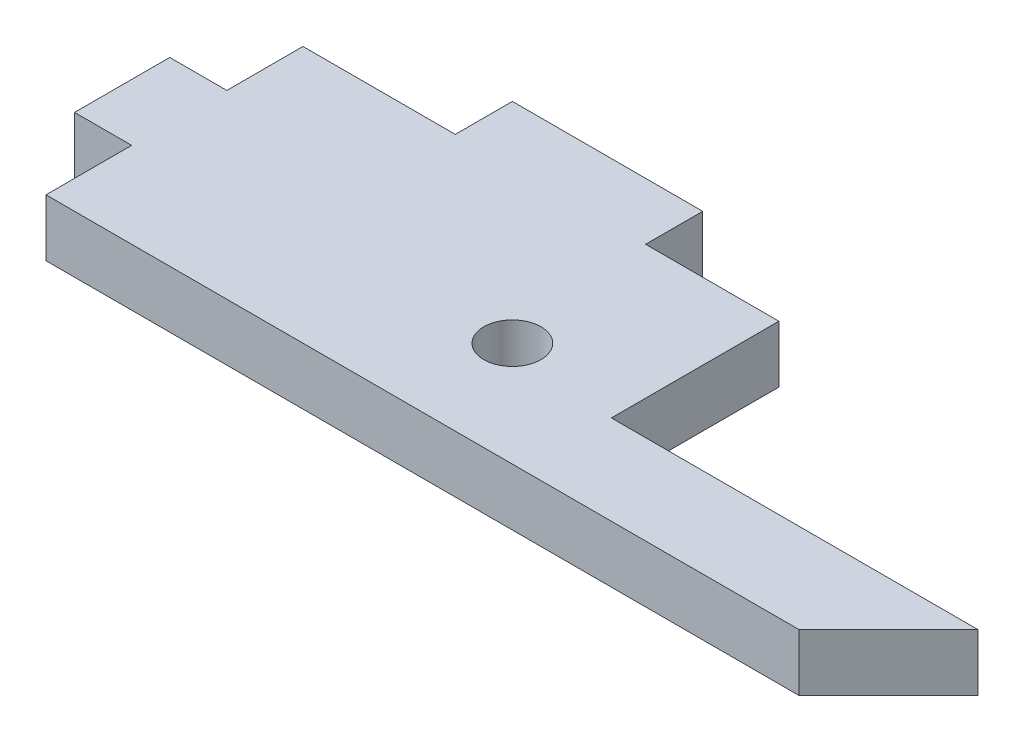
ISO-10303-21;
HEADER;
FILE_DESCRIPTION(('STEP AP214'),'2;1');
FILE_NAME('part.step','',(''),(''),'','','');
FILE_SCHEMA(('AUTOMOTIVE_DESIGN { 1 0 10303 214 1 1 1 1 }'));
ENDSEC;
DATA;
#1=APPLICATION_CONTEXT('core data for automotive mechanical design processes');
#2=APPLICATION_PROTOCOL_DEFINITION('international standard','automotive_design',2000,#1);
#3=PRODUCT_CONTEXT('',#1,'mechanical');
#4=PRODUCT('Part','Part','',(#3));
#5=PRODUCT_RELATED_PRODUCT_CATEGORY('part','',(#4));
#6=PRODUCT_DEFINITION_FORMATION('','',#4);
#7=PRODUCT_DEFINITION_CONTEXT('part definition',#1,'design');
#8=PRODUCT_DEFINITION('design','',#6,#7);
#9=PRODUCT_DEFINITION_SHAPE('','',#8);
#10=(LENGTH_UNIT() NAMED_UNIT(*) SI_UNIT(.MILLI.,.METRE.));
#11=(NAMED_UNIT(*) PLANE_ANGLE_UNIT() SI_UNIT($,.RADIAN.));
#12=(NAMED_UNIT(*) SI_UNIT($,.STERADIAN.) SOLID_ANGLE_UNIT());
#13=UNCERTAINTY_MEASURE_WITH_UNIT(LENGTH_MEASURE(1.E-05),#10,'distance_accuracy_value','');
#14=(GEOMETRIC_REPRESENTATION_CONTEXT(3) GLOBAL_UNCERTAINTY_ASSIGNED_CONTEXT((#13)) GLOBAL_UNIT_ASSIGNED_CONTEXT((#10,
#11,#12)) REPRESENTATION_CONTEXT('',''));
#15=CARTESIAN_POINT('',(0.,0.,0.));
#16=DIRECTION('',(0.,0.,1.));
#17=DIRECTION('',(1.,0.,0.));
#18=AXIS2_PLACEMENT_3D('',#15,#16,#17);
#19=CARTESIAN_POINT('',(0.,3.,0.));
#20=DIRECTION('',(0.,-1.,0.));
#21=DIRECTION('',(0.,0.,-1.));
#22=AXIS2_PLACEMENT_3D('',#19,#20,#21);
#23=PLANE('',#22);
#24=DIRECTION('',(0.,0.,1.));
#25=VECTOR('',#24,1.);
#26=CARTESIAN_POINT('',(-45.8890246544318,3.,12.6810465595323));
#27=LINE('',#26,#25);
#28=CARTESIAN_POINT('',(-45.8890246544318,3.,8.18104655953229));
#29=VERTEX_POINT('',#28);
#30=CARTESIAN_POINT('',(-45.8890246544318,3.,12.6810465595323));
#31=VERTEX_POINT('',#30);
#32=EDGE_CURVE('E192',#29,#31,#27,.T.);
#33=ORIENTED_EDGE('',*,*,#32,.T.);
#34=DIRECTION('',(1.,0.,0.));
#35=VECTOR('',#34,1.);
#36=CARTESIAN_POINT('',(-6.32902465443183,3.,12.6810465595323));
#37=LINE('',#36,#35);
#38=CARTESIAN_POINT('',(-6.32902465443183,3.,12.6810465595323));
#39=VERTEX_POINT('',#38);
#40=EDGE_CURVE('E110',#31,#39,#37,.T.);
#41=ORIENTED_EDGE('',*,*,#40,.T.);
#42=DIRECTION('',(0.707106781186546,0.,-0.707106781186549));
#43=VECTOR('',#42,1.);
#44=CARTESIAN_POINT('',(-1.62902465443185,3.,7.98104655953229));
#45=LINE('',#44,#43);
#46=CARTESIAN_POINT('',(-1.62902465443185,3.,7.98104655953229));
#47=VERTEX_POINT('',#46);
#48=EDGE_CURVE('E225',#39,#47,#45,.T.);
#49=ORIENTED_EDGE('',*,*,#48,.T.);
#50=DIRECTION('',(-1.,0.,0.));
#51=VECTOR('',#50,1.);
#52=CARTESIAN_POINT('',(-20.8890246544319,3.,7.98104655953229));
#53=LINE('',#52,#51);
#54=CARTESIAN_POINT('',(-20.8890246544319,3.,7.98104655953229));
#55=VERTEX_POINT('',#54);
#56=EDGE_CURVE('E244',#47,#55,#53,.T.);
#57=ORIENTED_EDGE('',*,*,#56,.T.);
#58=DIRECTION('',(0.,0.,-1.));
#59=VECTOR('',#58,1.);
#60=CARTESIAN_POINT('',(-20.8890246544319,3.,-0.818953440467708));
#61=LINE('',#60,#59);
#62=CARTESIAN_POINT('',(-20.8890246544319,3.,-0.818953440467708));
#63=VERTEX_POINT('',#62);
#64=EDGE_CURVE('E241',#55,#63,#61,.T.);
#65=ORIENTED_EDGE('',*,*,#64,.T.);
#66=DIRECTION('',(-1.,0.,0.));
#67=VECTOR('',#66,1.);
#68=CARTESIAN_POINT('',(-27.8890246544319,3.,-0.818953440467708));
#69=LINE('',#68,#67);
#70=CARTESIAN_POINT('',(-27.8890246544319,3.,-0.818953440467708));
#71=VERTEX_POINT('',#70);
#72=EDGE_CURVE('E243',#63,#71,#69,.T.);
#73=ORIENTED_EDGE('',*,*,#72,.T.);
#74=DIRECTION('',(0.,0.,-1.));
#75=VECTOR('',#74,1.);
#76=CARTESIAN_POINT('',(-27.8890246544318,3.,-3.81895344046771));
#77=LINE('',#76,#75);
#78=CARTESIAN_POINT('',(-27.8890246544318,3.,-3.81895344046771));
#79=VERTEX_POINT('',#78);
#80=EDGE_CURVE('E246',#71,#79,#77,.T.);
#81=ORIENTED_EDGE('',*,*,#80,.T.);
#82=DIRECTION('',(-1.,0.,0.));
#83=VECTOR('',#82,1.);
#84=CARTESIAN_POINT('',(-37.8890246544319,3.,-3.81895344046771));
#85=LINE('',#84,#83);
#86=CARTESIAN_POINT('',(-37.8890246544319,3.,-3.81895344046771));
#87=VERTEX_POINT('',#86);
#88=EDGE_CURVE('E252',#79,#87,#85,.T.);
#89=ORIENTED_EDGE('',*,*,#88,.T.);
#90=DIRECTION('',(0.,0.,1.));
#91=VECTOR('',#90,1.);
#92=CARTESIAN_POINT('',(-37.8890246544319,3.,-0.818953440467708));
#93=LINE('',#92,#91);
#94=CARTESIAN_POINT('',(-37.8890246544319,3.,-0.818953440467708));
#95=VERTEX_POINT('',#94);
#96=EDGE_CURVE('E254',#87,#95,#93,.T.);
#97=ORIENTED_EDGE('',*,*,#96,.T.);
#98=DIRECTION('',(-1.,0.,0.));
#99=VECTOR('',#98,1.);
#100=CARTESIAN_POINT('',(-45.8890246544319,3.,-0.818953440467708));
#101=LINE('',#100,#99);
#102=CARTESIAN_POINT('',(-45.8890246544319,3.,-0.818953440467708));
#103=VERTEX_POINT('',#102);
#104=EDGE_CURVE('E256',#95,#103,#101,.T.);
#105=ORIENTED_EDGE('',*,*,#104,.T.);
#106=DIRECTION('',(0.,0.,1.));
#107=VECTOR('',#106,1.);
#108=CARTESIAN_POINT('',(-45.8890246544319,3.,3.18104655953229));
#109=LINE('',#108,#107);
#110=CARTESIAN_POINT('',(-45.8890246544319,3.,3.18104655953229));
#111=VERTEX_POINT('',#110);
#112=EDGE_CURVE('E147',#103,#111,#109,.T.);
#113=ORIENTED_EDGE('',*,*,#112,.T.);
#114=DIRECTION('',(-1.,0.,0.));
#115=VECTOR('',#114,1.);
#116=CARTESIAN_POINT('',(-45.8890246544319,3.,3.18104655953229));
#117=LINE('',#116,#115);
#118=CARTESIAN_POINT('',(-48.8890246544318,3.,3.18104655953229));
#119=VERTEX_POINT('',#118);
#120=EDGE_CURVE('E141',#111,#119,#117,.T.);
#121=ORIENTED_EDGE('',*,*,#120,.T.);
#122=DIRECTION('',(0.,0.,1.));
#123=VECTOR('',#122,1.);
#124=CARTESIAN_POINT('',(-48.8890246544318,3.,3.18104655953229));
#125=LINE('',#124,#123);
#126=CARTESIAN_POINT('',(-48.8890246544318,3.,8.18104655953229));
#127=VERTEX_POINT('',#126);
#128=EDGE_CURVE('E145',#119,#127,#125,.T.);
#129=ORIENTED_EDGE('',*,*,#128,.T.);
#130=DIRECTION('',(1.,0.,0.));
#131=VECTOR('',#130,1.);
#132=CARTESIAN_POINT('',(-48.8890246544318,3.,8.18104655953229));
#133=LINE('',#132,#131);
#134=EDGE_CURVE('E49',#127,#29,#133,.T.);
#135=ORIENTED_EDGE('',*,*,#134,.T.);
#136=EDGE_LOOP('',(#33,#41,#49,#57,#65,#73,#81,#89,#97,#105,#113,#121,#129,#135));
#137=FACE_BOUND('',#136,.T.);
#138=CARTESIAN_POINT('',(-26.8890246544318,3.,7.18104655953229));
#139=DIRECTION('',(0.,1.,0.));
#140=DIRECTION('',(0.,0.,1.));
#141=AXIS2_PLACEMENT_3D('',#138,#139,#140);
#142=CIRCLE('',#141,1.5);
#143=CARTESIAN_POINT('',(-26.8890246544318,3.,8.68104655953229));
#144=VERTEX_POINT('',#143);
#145=EDGE_CURVE('E169',#144,#144,#142,.T.);
#146=ORIENTED_EDGE('',*,*,#145,.F.);
#147=EDGE_LOOP('',(#146));
#148=FACE_BOUND('',#147,.T.);
#149=ADVANCED_FACE('F32',(#137,#148),#23,.F.);
#150=CARTESIAN_POINT('',(0.,0.,0.));
#151=DIRECTION('',(0.,-1.,0.));
#152=DIRECTION('',(0.,0.,-1.));
#153=AXIS2_PLACEMENT_3D('',#150,#151,#152);
#154=PLANE('',#153);
#155=DIRECTION('',(0.,0.,1.));
#156=VECTOR('',#155,1.);
#157=CARTESIAN_POINT('',(-45.8890246544318,0.,12.6810465595323));
#158=LINE('',#157,#156);
#159=CARTESIAN_POINT('',(-45.8890246544318,0.,8.18104655953229));
#160=VERTEX_POINT('',#159);
#161=CARTESIAN_POINT('',(-45.8890246544318,0.,12.6810465595323));
#162=VERTEX_POINT('',#161);
#163=EDGE_CURVE('E165',#160,#162,#158,.T.);
#164=ORIENTED_EDGE('',*,*,#163,.F.);
#165=DIRECTION('',(1.,0.,0.));
#166=VECTOR('',#165,1.);
#167=CARTESIAN_POINT('',(-48.8890246544318,0.,8.18104655953229));
#168=LINE('',#167,#166);
#169=CARTESIAN_POINT('',(-48.8890246544318,0.,8.18104655953229));
#170=VERTEX_POINT('',#169);
#171=EDGE_CURVE('E102',#170,#160,#168,.T.);
#172=ORIENTED_EDGE('',*,*,#171,.F.);
#173=DIRECTION('',(0.,0.,1.));
#174=VECTOR('',#173,1.);
#175=CARTESIAN_POINT('',(-48.8890246544318,0.,3.18104655953229));
#176=LINE('',#175,#174);
#177=CARTESIAN_POINT('',(-48.8890246544318,0.,3.18104655953229));
#178=VERTEX_POINT('',#177);
#179=EDGE_CURVE('E96',#178,#170,#176,.T.);
#180=ORIENTED_EDGE('',*,*,#179,.F.);
#181=DIRECTION('',(-1.,0.,0.));
#182=VECTOR('',#181,1.);
#183=CARTESIAN_POINT('',(-45.8890246544319,0.,3.18104655953229));
#184=LINE('',#183,#182);
#185=CARTESIAN_POINT('',(-45.8890246544319,0.,3.18104655953229));
#186=VERTEX_POINT('',#185);
#187=EDGE_CURVE('E155',#186,#178,#184,.T.);
#188=ORIENTED_EDGE('',*,*,#187,.F.);
#189=DIRECTION('',(0.,0.,1.));
#190=VECTOR('',#189,1.);
#191=CARTESIAN_POINT('',(-45.8890246544319,0.,3.18104655953229));
#192=LINE('',#191,#190);
#193=CARTESIAN_POINT('',(-45.8890246544319,0.,-0.818953440467708));
#194=VERTEX_POINT('',#193);
#195=EDGE_CURVE('E187',#194,#186,#192,.T.);
#196=ORIENTED_EDGE('',*,*,#195,.F.);
#197=DIRECTION('',(-1.,0.,0.));
#198=VECTOR('',#197,1.);
#199=CARTESIAN_POINT('',(-45.8890246544319,0.,-0.818953440467708));
#200=LINE('',#199,#198);
#201=CARTESIAN_POINT('',(-37.8890246544319,0.,-0.818953440467708));
#202=VERTEX_POINT('',#201);
#203=EDGE_CURVE('E185',#202,#194,#200,.T.);
#204=ORIENTED_EDGE('',*,*,#203,.F.);
#205=DIRECTION('',(0.,0.,1.));
#206=VECTOR('',#205,1.);
#207=CARTESIAN_POINT('',(-37.8890246544319,0.,-0.818953440467708));
#208=LINE('',#207,#206);
#209=CARTESIAN_POINT('',(-37.8890246544319,0.,-3.81895344046771));
#210=VERTEX_POINT('',#209);
#211=EDGE_CURVE('E183',#210,#202,#208,.T.);
#212=ORIENTED_EDGE('',*,*,#211,.F.);
#213=DIRECTION('',(-1.,0.,0.));
#214=VECTOR('',#213,1.);
#215=CARTESIAN_POINT('',(-37.8890246544319,0.,-3.81895344046771));
#216=LINE('',#215,#214);
#217=CARTESIAN_POINT('',(-27.8890246544318,0.,-3.81895344046771));
#218=VERTEX_POINT('',#217);
#219=EDGE_CURVE('E181',#218,#210,#216,.T.);
#220=ORIENTED_EDGE('',*,*,#219,.F.);
#221=DIRECTION('',(0.,0.,-1.));
#222=VECTOR('',#221,1.);
#223=CARTESIAN_POINT('',(-27.8890246544318,0.,-3.81895344046771));
#224=LINE('',#223,#222);
#225=CARTESIAN_POINT('',(-27.8890246544319,0.,-0.818953440467708));
#226=VERTEX_POINT('',#225);
#227=EDGE_CURVE('E179',#226,#218,#224,.T.);
#228=ORIENTED_EDGE('',*,*,#227,.F.);
#229=DIRECTION('',(-1.,0.,0.));
#230=VECTOR('',#229,1.);
#231=CARTESIAN_POINT('',(-27.8890246544319,0.,-0.818953440467708));
#232=LINE('',#231,#230);
#233=CARTESIAN_POINT('',(-20.8890246544319,0.,-0.818953440467708));
#234=VERTEX_POINT('',#233);
#235=EDGE_CURVE('E177',#234,#226,#232,.T.);
#236=ORIENTED_EDGE('',*,*,#235,.F.);
#237=DIRECTION('',(0.,0.,-1.));
#238=VECTOR('',#237,1.);
#239=CARTESIAN_POINT('',(-20.8890246544319,0.,-0.818953440467708));
#240=LINE('',#239,#238);
#241=CARTESIAN_POINT('',(-20.8890246544319,0.,7.98104655953229));
#242=VERTEX_POINT('',#241);
#243=EDGE_CURVE('E175',#242,#234,#240,.T.);
#244=ORIENTED_EDGE('',*,*,#243,.F.);
#245=DIRECTION('',(-1.,0.,0.));
#246=VECTOR('',#245,1.);
#247=CARTESIAN_POINT('',(-20.8890246544319,0.,7.98104655953229));
#248=LINE('',#247,#246);
#249=CARTESIAN_POINT('',(-1.62902465443185,0.,7.98104655953229));
#250=VERTEX_POINT('',#249);
#251=EDGE_CURVE('E173',#250,#242,#248,.T.);
#252=ORIENTED_EDGE('',*,*,#251,.F.);
#253=DIRECTION('',(0.707106781186546,0.,-0.707106781186549));
#254=VECTOR('',#253,1.);
#255=CARTESIAN_POINT('',(-1.62902465443185,0.,7.98104655953229));
#256=LINE('',#255,#254);
#257=CARTESIAN_POINT('',(-6.32902465443183,0.,12.6810465595323));
#258=VERTEX_POINT('',#257);
#259=EDGE_CURVE('E171',#258,#250,#256,.T.);
#260=ORIENTED_EDGE('',*,*,#259,.F.);
#261=DIRECTION('',(1.,0.,0.));
#262=VECTOR('',#261,1.);
#263=CARTESIAN_POINT('',(-6.32902465443183,0.,12.6810465595323));
#264=LINE('',#263,#262);
#265=EDGE_CURVE('E168',#162,#258,#264,.T.);
#266=ORIENTED_EDGE('',*,*,#265,.F.);
#267=EDGE_LOOP('',(#164,#172,#180,#188,#196,#204,#212,#220,#228,#236,#244,#252,#260,#266));
#268=FACE_BOUND('',#267,.T.);
#269=CARTESIAN_POINT('',(-26.8890246544318,0.,7.18104655953229));
#270=DIRECTION('',(0.,1.,0.));
#271=DIRECTION('',(0.,0.,1.));
#272=AXIS2_PLACEMENT_3D('',#269,#270,#271);
#273=CIRCLE('',#272,1.5);
#274=CARTESIAN_POINT('',(-26.8890246544318,0.,8.68104655953229));
#275=VERTEX_POINT('',#274);
#276=EDGE_CURVE('E429',#275,#275,#273,.T.);
#277=ORIENTED_EDGE('',*,*,#276,.T.);
#278=EDGE_LOOP('',(#277));
#279=FACE_BOUND('',#278,.T.);
#280=ADVANCED_FACE('F229',(#268,#279),#154,.T.);
#281=CARTESIAN_POINT('',(-45.8890246544318,3.,12.6810465595323));
#282=DIRECTION('',(1.,0.,0.));
#283=DIRECTION('',(0.,0.,-1.));
#284=AXIS2_PLACEMENT_3D('',#281,#282,#283);
#285=PLANE('',#284);
#286=ORIENTED_EDGE('',*,*,#163,.T.);
#287=DIRECTION('',(0.,-1.,0.));
#288=VECTOR('',#287,1.);
#289=CARTESIAN_POINT('',(-45.8890246544318,3.,12.6810465595323));
#290=LINE('',#289,#288);
#291=EDGE_CURVE('E11',#31,#162,#290,.T.);
#292=ORIENTED_EDGE('',*,*,#291,.F.);
#293=ORIENTED_EDGE('',*,*,#32,.F.);
#294=DIRECTION('',(0.,-1.,0.));
#295=VECTOR('',#294,1.);
#296=CARTESIAN_POINT('',(-45.8890246544318,3.,8.18104655953229));
#297=LINE('',#296,#295);
#298=EDGE_CURVE('E161',#29,#160,#297,.T.);
#299=ORIENTED_EDGE('',*,*,#298,.T.);
#300=EDGE_LOOP('',(#286,#292,#293,#299));
#301=FACE_BOUND('',#300,.T.);
#302=ADVANCED_FACE('F34',(#301),#285,.F.);
#303=CARTESIAN_POINT('',(-6.32902465443183,3.,12.6810465595323));
#304=DIRECTION('',(0.,0.,-1.));
#305=DIRECTION('',(-1.,0.,0.));
#306=AXIS2_PLACEMENT_3D('',#303,#304,#305);
#307=PLANE('',#306);
#308=ORIENTED_EDGE('',*,*,#265,.T.);
#309=DIRECTION('',(0.,-1.,0.));
#310=VECTOR('',#309,1.);
#311=CARTESIAN_POINT('',(-6.32902465443183,3.,12.6810465595323));
#312=LINE('',#311,#310);
#313=EDGE_CURVE('E41',#39,#258,#312,.T.);
#314=ORIENTED_EDGE('',*,*,#313,.F.);
#315=ORIENTED_EDGE('',*,*,#40,.F.);
#316=ORIENTED_EDGE('',*,*,#291,.T.);
#317=EDGE_LOOP('',(#308,#314,#315,#316));
#318=FACE_BOUND('',#317,.T.);
#319=ADVANCED_FACE('F290',(#318),#307,.F.);
#320=CARTESIAN_POINT('',(-1.62902465443185,3.,7.98104655953229));
#321=DIRECTION('',(-0.707106781186549,0.,-0.707106781186546));
#322=DIRECTION('',(-0.707106781186546,0.,0.707106781186549));
#323=AXIS2_PLACEMENT_3D('',#320,#321,#322);
#324=PLANE('',#323);
#325=ORIENTED_EDGE('',*,*,#259,.T.);
#326=DIRECTION('',(0.,-1.,0.));
#327=VECTOR('',#326,1.);
#328=CARTESIAN_POINT('',(-1.62902465443185,3.,7.98104655953229));
#329=LINE('',#328,#327);
#330=EDGE_CURVE('E217',#47,#250,#329,.T.);
#331=ORIENTED_EDGE('',*,*,#330,.F.);
#332=ORIENTED_EDGE('',*,*,#48,.F.);
#333=ORIENTED_EDGE('',*,*,#313,.T.);
#334=EDGE_LOOP('',(#325,#331,#332,#333));
#335=FACE_BOUND('',#334,.T.);
#336=ADVANCED_FACE('F223',(#335),#324,.F.);
#337=CARTESIAN_POINT('',(-20.8890246544319,3.,7.98104655953229));
#338=DIRECTION('',(0.,0.,1.));
#339=DIRECTION('',(1.,0.,0.));
#340=AXIS2_PLACEMENT_3D('',#337,#338,#339);
#341=PLANE('',#340);
#342=ORIENTED_EDGE('',*,*,#251,.T.);
#343=DIRECTION('',(0.,-1.,0.));
#344=VECTOR('',#343,1.);
#345=CARTESIAN_POINT('',(-20.8890246544319,3.,7.98104655953229));
#346=LINE('',#345,#344);
#347=EDGE_CURVE('E214',#55,#242,#346,.T.);
#348=ORIENTED_EDGE('',*,*,#347,.F.);
#349=ORIENTED_EDGE('',*,*,#56,.F.);
#350=ORIENTED_EDGE('',*,*,#330,.T.);
#351=EDGE_LOOP('',(#342,#348,#349,#350));
#352=FACE_BOUND('',#351,.T.);
#353=ADVANCED_FACE('F235',(#352),#341,.F.);
#354=CARTESIAN_POINT('',(-20.8890246544319,3.,-0.818953440467708));
#355=DIRECTION('',(-1.,0.,0.));
#356=DIRECTION('',(0.,0.,1.));
#357=AXIS2_PLACEMENT_3D('',#354,#355,#356);
#358=PLANE('',#357);
#359=ORIENTED_EDGE('',*,*,#243,.T.);
#360=DIRECTION('',(0.,-1.,0.));
#361=VECTOR('',#360,1.);
#362=CARTESIAN_POINT('',(-20.8890246544319,3.,-0.818953440467708));
#363=LINE('',#362,#361);
#364=EDGE_CURVE('E211',#63,#234,#363,.T.);
#365=ORIENTED_EDGE('',*,*,#364,.F.);
#366=ORIENTED_EDGE('',*,*,#64,.F.);
#367=ORIENTED_EDGE('',*,*,#347,.T.);
#368=EDGE_LOOP('',(#359,#365,#366,#367));
#369=FACE_BOUND('',#368,.T.);
#370=ADVANCED_FACE('F239',(#369),#358,.F.);
#371=CARTESIAN_POINT('',(-27.8890246544319,3.,-0.818953440467708));
#372=DIRECTION('',(0.,0.,1.));
#373=DIRECTION('',(1.,0.,0.));
#374=AXIS2_PLACEMENT_3D('',#371,#372,#373);
#375=PLANE('',#374);
#376=ORIENTED_EDGE('',*,*,#235,.T.);
#377=DIRECTION('',(0.,-1.,0.));
#378=VECTOR('',#377,1.);
#379=CARTESIAN_POINT('',(-27.8890246544319,3.,-0.818953440467708));
#380=LINE('',#379,#378);
#381=EDGE_CURVE('E208',#71,#226,#380,.T.);
#382=ORIENTED_EDGE('',*,*,#381,.F.);
#383=ORIENTED_EDGE('',*,*,#72,.F.);
#384=ORIENTED_EDGE('',*,*,#364,.T.);
#385=EDGE_LOOP('',(#376,#382,#383,#384));
#386=FACE_BOUND('',#385,.T.);
#387=ADVANCED_FACE('F303',(#386),#375,.F.);
#388=CARTESIAN_POINT('',(-27.8890246544318,3.,-3.81895344046771));
#389=DIRECTION('',(-1.,0.,0.));
#390=DIRECTION('',(0.,0.,1.));
#391=AXIS2_PLACEMENT_3D('',#388,#389,#390);
#392=PLANE('',#391);
#393=ORIENTED_EDGE('',*,*,#227,.T.);
#394=DIRECTION('',(0.,-1.,0.));
#395=VECTOR('',#394,1.);
#396=CARTESIAN_POINT('',(-27.8890246544318,3.,-3.81895344046771));
#397=LINE('',#396,#395);
#398=EDGE_CURVE('E205',#79,#218,#397,.T.);
#399=ORIENTED_EDGE('',*,*,#398,.F.);
#400=ORIENTED_EDGE('',*,*,#80,.F.);
#401=ORIENTED_EDGE('',*,*,#381,.T.);
#402=EDGE_LOOP('',(#393,#399,#400,#401));
#403=FACE_BOUND('',#402,.T.);
#404=ADVANCED_FACE('F306',(#403),#392,.F.);
#405=CARTESIAN_POINT('',(-37.8890246544319,3.,-3.81895344046771));
#406=DIRECTION('',(0.,0.,1.));
#407=DIRECTION('',(1.,0.,0.));
#408=AXIS2_PLACEMENT_3D('',#405,#406,#407);
#409=PLANE('',#408);
#410=ORIENTED_EDGE('',*,*,#219,.T.);
#411=DIRECTION('',(0.,-1.,0.));
#412=VECTOR('',#411,1.);
#413=CARTESIAN_POINT('',(-37.8890246544319,3.,-3.81895344046771));
#414=LINE('',#413,#412);
#415=EDGE_CURVE('E202',#87,#210,#414,.T.);
#416=ORIENTED_EDGE('',*,*,#415,.F.);
#417=ORIENTED_EDGE('',*,*,#88,.F.);
#418=ORIENTED_EDGE('',*,*,#398,.T.);
#419=EDGE_LOOP('',(#410,#416,#417,#418));
#420=FACE_BOUND('',#419,.T.);
#421=ADVANCED_FACE('F310',(#420),#409,.F.);
#422=CARTESIAN_POINT('',(-37.8890246544319,3.,-0.818953440467708));
#423=DIRECTION('',(1.,0.,0.));
#424=DIRECTION('',(0.,0.,-1.));
#425=AXIS2_PLACEMENT_3D('',#422,#423,#424);
#426=PLANE('',#425);
#427=ORIENTED_EDGE('',*,*,#211,.T.);
#428=DIRECTION('',(0.,-1.,0.));
#429=VECTOR('',#428,1.);
#430=CARTESIAN_POINT('',(-37.8890246544319,3.,-0.818953440467708));
#431=LINE('',#430,#429);
#432=EDGE_CURVE('E199',#95,#202,#431,.T.);
#433=ORIENTED_EDGE('',*,*,#432,.F.);
#434=ORIENTED_EDGE('',*,*,#96,.F.);
#435=ORIENTED_EDGE('',*,*,#415,.T.);
#436=EDGE_LOOP('',(#427,#433,#434,#435));
#437=FACE_BOUND('',#436,.T.);
#438=ADVANCED_FACE('F314',(#437),#426,.F.);
#439=CARTESIAN_POINT('',(-45.8890246544319,3.,-0.818953440467708));
#440=DIRECTION('',(0.,0.,1.));
#441=DIRECTION('',(1.,0.,0.));
#442=AXIS2_PLACEMENT_3D('',#439,#440,#441);
#443=PLANE('',#442);
#444=ORIENTED_EDGE('',*,*,#203,.T.);
#445=DIRECTION('',(0.,-1.,0.));
#446=VECTOR('',#445,1.);
#447=CARTESIAN_POINT('',(-45.8890246544319,3.,-0.818953440467708));
#448=LINE('',#447,#446);
#449=EDGE_CURVE('E196',#103,#194,#448,.T.);
#450=ORIENTED_EDGE('',*,*,#449,.F.);
#451=ORIENTED_EDGE('',*,*,#104,.F.);
#452=ORIENTED_EDGE('',*,*,#432,.T.);
#453=EDGE_LOOP('',(#444,#450,#451,#452));
#454=FACE_BOUND('',#453,.T.);
#455=ADVANCED_FACE('F262',(#454),#443,.F.);
#456=CARTESIAN_POINT('',(-45.8890246544319,3.,3.18104655953229));
#457=DIRECTION('',(1.,0.,0.));
#458=DIRECTION('',(0.,0.,-1.));
#459=AXIS2_PLACEMENT_3D('',#456,#457,#458);
#460=PLANE('',#459);
#461=ORIENTED_EDGE('',*,*,#195,.T.);
#462=DIRECTION('',(0.,-1.,0.));
#463=VECTOR('',#462,1.);
#464=CARTESIAN_POINT('',(-45.8890246544319,3.,3.18104655953229));
#465=LINE('',#464,#463);
#466=EDGE_CURVE('E156',#111,#186,#465,.T.);
#467=ORIENTED_EDGE('',*,*,#466,.F.);
#468=ORIENTED_EDGE('',*,*,#112,.F.);
#469=ORIENTED_EDGE('',*,*,#449,.T.);
#470=EDGE_LOOP('',(#461,#467,#468,#469));
#471=FACE_BOUND('',#470,.T.);
#472=ADVANCED_FACE('F266',(#471),#460,.F.);
#473=CARTESIAN_POINT('',(-45.8890246544319,3.,3.18104655953229));
#474=DIRECTION('',(0.,0.,1.));
#475=DIRECTION('',(1.,0.,0.));
#476=AXIS2_PLACEMENT_3D('',#473,#474,#475);
#477=PLANE('',#476);
#478=ORIENTED_EDGE('',*,*,#187,.T.);
#479=DIRECTION('',(0.,-1.,0.));
#480=VECTOR('',#479,1.);
#481=CARTESIAN_POINT('',(-48.8890246544318,3.,3.18104655953229));
#482=LINE('',#481,#480);
#483=EDGE_CURVE('E152',#119,#178,#482,.T.);
#484=ORIENTED_EDGE('',*,*,#483,.F.);
#485=ORIENTED_EDGE('',*,*,#120,.F.);
#486=ORIENTED_EDGE('',*,*,#466,.T.);
#487=EDGE_LOOP('',(#478,#484,#485,#486));
#488=FACE_BOUND('',#487,.T.);
#489=ADVANCED_FACE('F153',(#488),#477,.F.);
#490=CARTESIAN_POINT('',(-48.8890246544318,3.,3.18104655953229));
#491=DIRECTION('',(1.,0.,0.));
#492=DIRECTION('',(0.,0.,-1.));
#493=AXIS2_PLACEMENT_3D('',#490,#491,#492);
#494=PLANE('',#493);
#495=ORIENTED_EDGE('',*,*,#179,.T.);
#496=DIRECTION('',(0.,-1.,0.));
#497=VECTOR('',#496,1.);
#498=CARTESIAN_POINT('',(-48.8890246544318,3.,8.18104655953229));
#499=LINE('',#498,#497);
#500=EDGE_CURVE('E157',#127,#170,#499,.T.);
#501=ORIENTED_EDGE('',*,*,#500,.F.);
#502=ORIENTED_EDGE('',*,*,#128,.F.);
#503=ORIENTED_EDGE('',*,*,#483,.T.);
#504=EDGE_LOOP('',(#495,#501,#502,#503));
#505=FACE_BOUND('',#504,.T.);
#506=ADVANCED_FACE('F159',(#505),#494,.F.);
#507=CARTESIAN_POINT('',(-48.8890246544318,3.,8.18104655953229));
#508=DIRECTION('',(0.,0.,-1.));
#509=DIRECTION('',(-1.,0.,0.));
#510=AXIS2_PLACEMENT_3D('',#507,#508,#509);
#511=PLANE('',#510);
#512=ORIENTED_EDGE('',*,*,#171,.T.);
#513=ORIENTED_EDGE('',*,*,#298,.F.);
#514=ORIENTED_EDGE('',*,*,#134,.F.);
#515=ORIENTED_EDGE('',*,*,#500,.T.);
#516=EDGE_LOOP('',(#512,#513,#514,#515));
#517=FACE_BOUND('',#516,.T.);
#518=ADVANCED_FACE('F270',(#517),#511,.F.);
#519=CARTESIAN_POINT('',(-26.8890246544318,3.,7.18104655953229));
#520=DIRECTION('',(0.,-1.,0.));
#521=DIRECTION('',(0.,0.,-1.));
#522=AXIS2_PLACEMENT_3D('',#519,#520,#521);
#523=CYLINDRICAL_SURFACE('',#522,1.5);
#524=ORIENTED_EDGE('',*,*,#145,.T.);
#525=EDGE_LOOP('',(#524));
#526=FACE_BOUND('',#525,.T.);
#527=ORIENTED_EDGE('',*,*,#276,.F.);
#528=EDGE_LOOP('',(#527));
#529=FACE_BOUND('',#528,.T.);
#530=ADVANCED_FACE('F272',(#526,#529),#523,.F.);
#531=CLOSED_SHELL('',(#149,#280,#302,#319,#336,#353,#370,#387,#404,#421,#438,#455,#472,#489,
#506,#518,#530));
#532=MANIFOLD_SOLID_BREP('B2',#531);
#533=ADVANCED_BREP_SHAPE_REPRESENTATION('',(#18,#532),#14);
#534=SHAPE_DEFINITION_REPRESENTATION(#9,#533);
ENDSEC;
END-ISO-10303-21;
